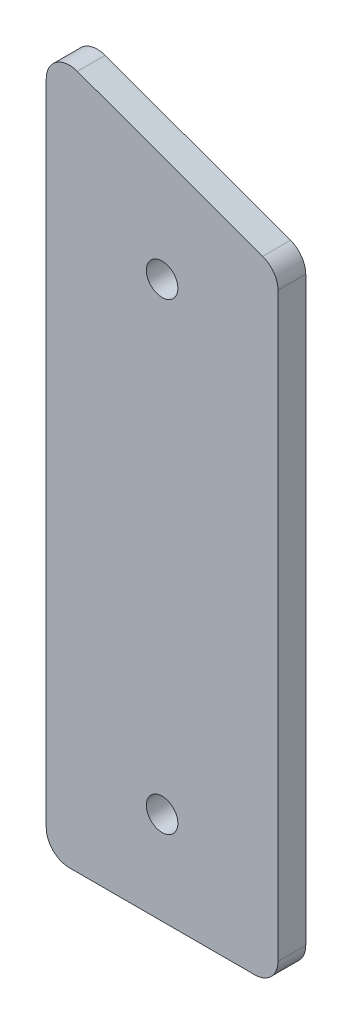
ISO-10303-21;
HEADER;
FILE_DESCRIPTION(('STEP AP214'),'2;1');
FILE_NAME('part.step','',(''),(''),'','','');
FILE_SCHEMA(('AUTOMOTIVE_DESIGN { 1 0 10303 214 1 1 1 1 }'));
ENDSEC;
DATA;
#1=APPLICATION_CONTEXT('core data for automotive mechanical design processes');
#2=APPLICATION_PROTOCOL_DEFINITION('international standard','automotive_design',2000,#1);
#3=PRODUCT_CONTEXT('',#1,'mechanical');
#4=PRODUCT('Part','Part','',(#3));
#5=PRODUCT_RELATED_PRODUCT_CATEGORY('part','',(#4));
#6=PRODUCT_DEFINITION_FORMATION('','',#4);
#7=PRODUCT_DEFINITION_CONTEXT('part definition',#1,'design');
#8=PRODUCT_DEFINITION('design','',#6,#7);
#9=PRODUCT_DEFINITION_SHAPE('','',#8);
#10=(LENGTH_UNIT() NAMED_UNIT(*) SI_UNIT(.MILLI.,.METRE.));
#11=(NAMED_UNIT(*) PLANE_ANGLE_UNIT() SI_UNIT($,.RADIAN.));
#12=(NAMED_UNIT(*) SI_UNIT($,.STERADIAN.) SOLID_ANGLE_UNIT());
#13=UNCERTAINTY_MEASURE_WITH_UNIT(LENGTH_MEASURE(1.E-05),#10,'distance_accuracy_value','');
#14=(GEOMETRIC_REPRESENTATION_CONTEXT(3) GLOBAL_UNCERTAINTY_ASSIGNED_CONTEXT((#13)) GLOBAL_UNIT_ASSIGNED_CONTEXT((#10,
#11,#12)) REPRESENTATION_CONTEXT('',''));
#15=CARTESIAN_POINT('',(0.,0.,0.));
#16=DIRECTION('',(0.,0.,1.));
#17=DIRECTION('',(1.,0.,0.));
#18=AXIS2_PLACEMENT_3D('',#15,#16,#17);
#19=CARTESIAN_POINT('',(20.,5.,6.));
#20=DIRECTION('',(0.,0.,-1.));
#21=DIRECTION('',(-1.,0.,0.));
#22=AXIS2_PLACEMENT_3D('',#19,#20,#21);
#23=PLANE('',#22);
#24=CARTESIAN_POINT('',(0.,120.,6.));
#25=DIRECTION('',(0.,0.,1.));
#26=DIRECTION('',(1.,0.,0.));
#27=AXIS2_PLACEMENT_3D('',#24,#25,#26);
#28=CIRCLE('',#27,3.40000000000003);
#29=CARTESIAN_POINT('',(3.40000000000003,120.,6.));
#30=VERTEX_POINT('',#29);
#31=EDGE_CURVE('E146',#30,#30,#28,.T.);
#32=ORIENTED_EDGE('',*,*,#31,.F.);
#33=EDGE_LOOP('',(#32));
#34=FACE_BOUND('',#33,.T.);
#35=CARTESIAN_POINT('',(20.,5.,6.));
#36=DIRECTION('',(0.,0.,1.));
#37=DIRECTION('',(-1.,0.,0.));
#38=AXIS2_PLACEMENT_3D('',#35,#36,#37);
#39=CIRCLE('',#38,5.);
#40=CARTESIAN_POINT('',(20.,0.,6.));
#41=VERTEX_POINT('',#40);
#42=CARTESIAN_POINT('',(25.,5.,6.));
#43=VERTEX_POINT('',#42);
#44=EDGE_CURVE('E157',#41,#43,#39,.T.);
#45=ORIENTED_EDGE('',*,*,#44,.T.);
#46=DIRECTION('',(0.,1.,0.));
#47=VECTOR('',#46,1.);
#48=CARTESIAN_POINT('',(25.,5.,6.));
#49=LINE('',#48,#47);
#50=CARTESIAN_POINT('',(25.,130.441190629352,6.));
#51=VERTEX_POINT('',#50);
#52=EDGE_CURVE('E105',#43,#51,#49,.T.);
#53=ORIENTED_EDGE('',*,*,#52,.T.);
#54=CARTESIAN_POINT('',(20.,130.441190629352,6.));
#55=DIRECTION('',(0.,0.,1.));
#56=DIRECTION('',(1.,0.,0.));
#57=AXIS2_PLACEMENT_3D('',#54,#55,#56);
#58=CIRCLE('',#57,5.00000000000001);
#59=CARTESIAN_POINT('',(21.7101007166284,135.139653733281,6.));
#60=VERTEX_POINT('',#59);
#61=EDGE_CURVE('E172',#51,#60,#58,.T.);
#62=ORIENTED_EDGE('',*,*,#61,.T.);
#63=DIRECTION('',(-0.939692620785906,0.342020143325674,0.));
#64=VECTOR('',#63,1.);
#65=CARTESIAN_POINT('',(-18.2898992833716,149.69846310393,6.));
#66=LINE('',#65,#64);
#67=CARTESIAN_POINT('',(-18.2898992833716,149.69846310393,6.));
#68=VERTEX_POINT('',#67);
#69=EDGE_CURVE('E185',#60,#68,#66,.T.);
#70=ORIENTED_EDGE('',*,*,#69,.T.);
#71=CARTESIAN_POINT('',(-20.,145.,6.));
#72=DIRECTION('',(0.,0.,1.));
#73=DIRECTION('',(1.,0.,0.));
#74=AXIS2_PLACEMENT_3D('',#71,#72,#73);
#75=CIRCLE('',#74,5.00000000000002);
#76=CARTESIAN_POINT('',(-25.,145.,6.));
#77=VERTEX_POINT('',#76);
#78=EDGE_CURVE('E124',#68,#77,#75,.T.);
#79=ORIENTED_EDGE('',*,*,#78,.T.);
#80=DIRECTION('',(0.,-1.,0.));
#81=VECTOR('',#80,1.);
#82=CARTESIAN_POINT('',(-25.,5.,6.));
#83=LINE('',#82,#81);
#84=CARTESIAN_POINT('',(-25.,5.,6.));
#85=VERTEX_POINT('',#84);
#86=EDGE_CURVE('E118',#77,#85,#83,.T.);
#87=ORIENTED_EDGE('',*,*,#86,.T.);
#88=CARTESIAN_POINT('',(-20.,5.,6.));
#89=DIRECTION('',(0.,0.,1.));
#90=DIRECTION('',(1.,0.,0.));
#91=AXIS2_PLACEMENT_3D('',#88,#89,#90);
#92=CIRCLE('',#91,5.);
#93=CARTESIAN_POINT('',(-20.,0.,6.));
#94=VERTEX_POINT('',#93);
#95=EDGE_CURVE('E122',#85,#94,#92,.T.);
#96=ORIENTED_EDGE('',*,*,#95,.T.);
#97=DIRECTION('',(1.,0.,0.));
#98=VECTOR('',#97,1.);
#99=CARTESIAN_POINT('',(-20.,0.,6.));
#100=LINE('',#99,#98);
#101=EDGE_CURVE('E62',#94,#41,#100,.T.);
#102=ORIENTED_EDGE('',*,*,#101,.T.);
#103=EDGE_LOOP('',(#45,#53,#62,#70,#79,#87,#96,#102));
#104=FACE_BOUND('',#103,.T.);
#105=CARTESIAN_POINT('',(0.,20.,6.));
#106=DIRECTION('',(0.,0.,1.));
#107=DIRECTION('',(1.,0.,0.));
#108=AXIS2_PLACEMENT_3D('',#105,#106,#107);
#109=CIRCLE('',#108,3.40000000000002);
#110=CARTESIAN_POINT('',(3.40000000000002,20.,6.));
#111=VERTEX_POINT('',#110);
#112=EDGE_CURVE('E194',#111,#111,#109,.T.);
#113=ORIENTED_EDGE('',*,*,#112,.F.);
#114=EDGE_LOOP('',(#113));
#115=FACE_BOUND('',#114,.T.);
#116=ADVANCED_FACE('F45',(#34,#104,#115),#23,.F.);
#117=CARTESIAN_POINT('',(20.,5.,0.));
#118=DIRECTION('',(0.,0.,-1.));
#119=DIRECTION('',(-1.,0.,0.));
#120=AXIS2_PLACEMENT_3D('',#117,#118,#119);
#121=PLANE('',#120);
#122=CARTESIAN_POINT('',(0.,120.,0.));
#123=DIRECTION('',(0.,0.,1.));
#124=DIRECTION('',(1.,0.,0.));
#125=AXIS2_PLACEMENT_3D('',#122,#123,#124);
#126=CIRCLE('',#125,3.40000000000003);
#127=CARTESIAN_POINT('',(3.40000000000003,120.,0.));
#128=VERTEX_POINT('',#127);
#129=EDGE_CURVE('E191',#128,#128,#126,.T.);
#130=ORIENTED_EDGE('',*,*,#129,.T.);
#131=EDGE_LOOP('',(#130));
#132=FACE_BOUND('',#131,.T.);
#133=CARTESIAN_POINT('',(20.,5.,0.));
#134=DIRECTION('',(0.,0.,1.));
#135=DIRECTION('',(-1.,0.,0.));
#136=AXIS2_PLACEMENT_3D('',#133,#134,#135);
#137=CIRCLE('',#136,5.);
#138=CARTESIAN_POINT('',(20.,0.,0.));
#139=VERTEX_POINT('',#138);
#140=CARTESIAN_POINT('',(25.,5.,0.));
#141=VERTEX_POINT('',#140);
#142=EDGE_CURVE('E142',#139,#141,#137,.T.);
#143=ORIENTED_EDGE('',*,*,#142,.F.);
#144=DIRECTION('',(1.,0.,0.));
#145=VECTOR('',#144,1.);
#146=CARTESIAN_POINT('',(-20.,0.,0.));
#147=LINE('',#146,#145);
#148=CARTESIAN_POINT('',(-20.,0.,0.));
#149=VERTEX_POINT('',#148);
#150=EDGE_CURVE('E97',#149,#139,#147,.T.);
#151=ORIENTED_EDGE('',*,*,#150,.F.);
#152=CARTESIAN_POINT('',(-20.,5.,0.));
#153=DIRECTION('',(0.,0.,1.));
#154=DIRECTION('',(1.,0.,0.));
#155=AXIS2_PLACEMENT_3D('',#152,#153,#154);
#156=CIRCLE('',#155,5.);
#157=CARTESIAN_POINT('',(-25.,5.,0.));
#158=VERTEX_POINT('',#157);
#159=EDGE_CURVE('E91',#158,#149,#156,.T.);
#160=ORIENTED_EDGE('',*,*,#159,.F.);
#161=DIRECTION('',(0.,-1.,0.));
#162=VECTOR('',#161,1.);
#163=CARTESIAN_POINT('',(-25.,5.,0.));
#164=LINE('',#163,#162);
#165=CARTESIAN_POINT('',(-25.,145.,0.));
#166=VERTEX_POINT('',#165);
#167=EDGE_CURVE('E132',#166,#158,#164,.T.);
#168=ORIENTED_EDGE('',*,*,#167,.F.);
#169=CARTESIAN_POINT('',(-20.,145.,0.));
#170=DIRECTION('',(0.,0.,1.));
#171=DIRECTION('',(1.,0.,0.));
#172=AXIS2_PLACEMENT_3D('',#169,#170,#171);
#173=CIRCLE('',#172,5.00000000000002);
#174=CARTESIAN_POINT('',(-18.2898992833716,149.69846310393,0.));
#175=VERTEX_POINT('',#174);
#176=EDGE_CURVE('E152',#175,#166,#173,.T.);
#177=ORIENTED_EDGE('',*,*,#176,.F.);
#178=DIRECTION('',(-0.939692620785906,0.342020143325674,0.));
#179=VECTOR('',#178,1.);
#180=CARTESIAN_POINT('',(-18.2898992833716,149.69846310393,0.));
#181=LINE('',#180,#179);
#182=CARTESIAN_POINT('',(21.7101007166284,135.139653733281,0.));
#183=VERTEX_POINT('',#182);
#184=EDGE_CURVE('E150',#183,#175,#181,.T.);
#185=ORIENTED_EDGE('',*,*,#184,.F.);
#186=CARTESIAN_POINT('',(20.,130.441190629352,0.));
#187=DIRECTION('',(0.,0.,1.));
#188=DIRECTION('',(1.,0.,0.));
#189=AXIS2_PLACEMENT_3D('',#186,#187,#188);
#190=CIRCLE('',#189,5.00000000000001);
#191=CARTESIAN_POINT('',(25.,130.441190629352,0.));
#192=VERTEX_POINT('',#191);
#193=EDGE_CURVE('E148',#192,#183,#190,.T.);
#194=ORIENTED_EDGE('',*,*,#193,.F.);
#195=DIRECTION('',(0.,1.,0.));
#196=VECTOR('',#195,1.);
#197=CARTESIAN_POINT('',(25.,5.,0.));
#198=LINE('',#197,#196);
#199=EDGE_CURVE('E145',#141,#192,#198,.T.);
#200=ORIENTED_EDGE('',*,*,#199,.F.);
#201=EDGE_LOOP('',(#143,#151,#160,#168,#177,#185,#194,#200));
#202=FACE_BOUND('',#201,.T.);
#203=CARTESIAN_POINT('',(0.,20.,0.));
#204=DIRECTION('',(0.,0.,1.));
#205=DIRECTION('',(1.,0.,0.));
#206=AXIS2_PLACEMENT_3D('',#203,#204,#205);
#207=CIRCLE('',#206,3.40000000000002);
#208=CARTESIAN_POINT('',(3.40000000000002,20.,0.));
#209=VERTEX_POINT('',#208);
#210=EDGE_CURVE('E197',#209,#209,#207,.T.);
#211=ORIENTED_EDGE('',*,*,#210,.T.);
#212=EDGE_LOOP('',(#211));
#213=FACE_BOUND('',#212,.T.);
#214=ADVANCED_FACE('F176',(#132,#202,#213),#121,.T.);
#215=CARTESIAN_POINT('',(20.,5.,6.));
#216=DIRECTION('',(0.,0.,-1.));
#217=DIRECTION('',(-1.,0.,0.));
#218=AXIS2_PLACEMENT_3D('',#215,#216,#217);
#219=CYLINDRICAL_SURFACE('',#218,5.);
#220=ORIENTED_EDGE('',*,*,#142,.T.);
#221=DIRECTION('',(0.,0.,-1.));
#222=VECTOR('',#221,1.);
#223=CARTESIAN_POINT('',(25.,5.,6.));
#224=LINE('',#223,#222);
#225=EDGE_CURVE('E11',#43,#141,#224,.T.);
#226=ORIENTED_EDGE('',*,*,#225,.F.);
#227=ORIENTED_EDGE('',*,*,#44,.F.);
#228=DIRECTION('',(0.,0.,-1.));
#229=VECTOR('',#228,1.);
#230=CARTESIAN_POINT('',(20.,0.,6.));
#231=LINE('',#230,#229);
#232=EDGE_CURVE('E138',#41,#139,#231,.T.);
#233=ORIENTED_EDGE('',*,*,#232,.T.);
#234=EDGE_LOOP('',(#220,#226,#227,#233));
#235=FACE_BOUND('',#234,.T.);
#236=ADVANCED_FACE('F47',(#235),#219,.T.);
#237=CARTESIAN_POINT('',(25.,5.,6.));
#238=DIRECTION('',(-1.,0.,0.));
#239=DIRECTION('',(0.,0.,1.));
#240=AXIS2_PLACEMENT_3D('',#237,#238,#239);
#241=PLANE('',#240);
#242=ORIENTED_EDGE('',*,*,#199,.T.);
#243=DIRECTION('',(0.,0.,-1.));
#244=VECTOR('',#243,1.);
#245=CARTESIAN_POINT('',(25.,130.441190629352,6.));
#246=LINE('',#245,#244);
#247=EDGE_CURVE('E54',#51,#192,#246,.T.);
#248=ORIENTED_EDGE('',*,*,#247,.F.);
#249=ORIENTED_EDGE('',*,*,#52,.F.);
#250=ORIENTED_EDGE('',*,*,#225,.T.);
#251=EDGE_LOOP('',(#242,#248,#249,#250));
#252=FACE_BOUND('',#251,.T.);
#253=ADVANCED_FACE('F230',(#252),#241,.F.);
#254=CARTESIAN_POINT('',(20.,130.441190629352,6.));
#255=DIRECTION('',(0.,0.,-1.));
#256=DIRECTION('',(-1.,0.,0.));
#257=AXIS2_PLACEMENT_3D('',#254,#255,#256);
#258=CYLINDRICAL_SURFACE('',#257,5.00000000000001);
#259=ORIENTED_EDGE('',*,*,#193,.T.);
#260=DIRECTION('',(0.,0.,-1.));
#261=VECTOR('',#260,1.);
#262=CARTESIAN_POINT('',(21.7101007166284,135.139653733281,6.));
#263=LINE('',#262,#261);
#264=EDGE_CURVE('E164',#60,#183,#263,.T.);
#265=ORIENTED_EDGE('',*,*,#264,.F.);
#266=ORIENTED_EDGE('',*,*,#61,.F.);
#267=ORIENTED_EDGE('',*,*,#247,.T.);
#268=EDGE_LOOP('',(#259,#265,#266,#267));
#269=FACE_BOUND('',#268,.T.);
#270=ADVANCED_FACE('F170',(#269),#258,.T.);
#271=CARTESIAN_POINT('',(-18.2898992833716,149.69846310393,6.));
#272=DIRECTION('',(-0.342020143325674,-0.939692620785906,0.));
#273=DIRECTION('',(0.939692620785907,-0.342020143325674,0.));
#274=AXIS2_PLACEMENT_3D('',#271,#272,#273);
#275=PLANE('',#274);
#276=ORIENTED_EDGE('',*,*,#184,.T.);
#277=DIRECTION('',(0.,0.,-1.));
#278=VECTOR('',#277,1.);
#279=CARTESIAN_POINT('',(-18.2898992833716,149.69846310393,6.));
#280=LINE('',#279,#278);
#281=EDGE_CURVE('E161',#68,#175,#280,.T.);
#282=ORIENTED_EDGE('',*,*,#281,.F.);
#283=ORIENTED_EDGE('',*,*,#69,.F.);
#284=ORIENTED_EDGE('',*,*,#264,.T.);
#285=EDGE_LOOP('',(#276,#282,#283,#284));
#286=FACE_BOUND('',#285,.T.);
#287=ADVANCED_FACE('F181',(#286),#275,.F.);
#288=CARTESIAN_POINT('',(-20.,145.,6.));
#289=DIRECTION('',(0.,0.,-1.));
#290=DIRECTION('',(-1.,0.,0.));
#291=AXIS2_PLACEMENT_3D('',#288,#289,#290);
#292=CYLINDRICAL_SURFACE('',#291,5.00000000000002);
#293=ORIENTED_EDGE('',*,*,#176,.T.);
#294=DIRECTION('',(0.,0.,-1.));
#295=VECTOR('',#294,1.);
#296=CARTESIAN_POINT('',(-25.,145.,6.));
#297=LINE('',#296,#295);
#298=EDGE_CURVE('E133',#77,#166,#297,.T.);
#299=ORIENTED_EDGE('',*,*,#298,.F.);
#300=ORIENTED_EDGE('',*,*,#78,.F.);
#301=ORIENTED_EDGE('',*,*,#281,.T.);
#302=EDGE_LOOP('',(#293,#299,#300,#301));
#303=FACE_BOUND('',#302,.T.);
#304=ADVANCED_FACE('F184',(#303),#292,.T.);
#305=CARTESIAN_POINT('',(-25.,5.,6.));
#306=DIRECTION('',(1.,0.,0.));
#307=DIRECTION('',(0.,0.,-1.));
#308=AXIS2_PLACEMENT_3D('',#305,#306,#307);
#309=PLANE('',#308);
#310=ORIENTED_EDGE('',*,*,#167,.T.);
#311=DIRECTION('',(0.,0.,-1.));
#312=VECTOR('',#311,1.);
#313=CARTESIAN_POINT('',(-25.,5.,6.));
#314=LINE('',#313,#312);
#315=EDGE_CURVE('E129',#85,#158,#314,.T.);
#316=ORIENTED_EDGE('',*,*,#315,.F.);
#317=ORIENTED_EDGE('',*,*,#86,.F.);
#318=ORIENTED_EDGE('',*,*,#298,.T.);
#319=EDGE_LOOP('',(#310,#316,#317,#318));
#320=FACE_BOUND('',#319,.T.);
#321=ADVANCED_FACE('F130',(#320),#309,.F.);
#322=CARTESIAN_POINT('',(-20.,5.,6.));
#323=DIRECTION('',(0.,0.,-1.));
#324=DIRECTION('',(-1.,0.,0.));
#325=AXIS2_PLACEMENT_3D('',#322,#323,#324);
#326=CYLINDRICAL_SURFACE('',#325,5.);
#327=ORIENTED_EDGE('',*,*,#159,.T.);
#328=DIRECTION('',(0.,0.,-1.));
#329=VECTOR('',#328,1.);
#330=CARTESIAN_POINT('',(-20.,0.,6.));
#331=LINE('',#330,#329);
#332=EDGE_CURVE('E134',#94,#149,#331,.T.);
#333=ORIENTED_EDGE('',*,*,#332,.F.);
#334=ORIENTED_EDGE('',*,*,#95,.F.);
#335=ORIENTED_EDGE('',*,*,#315,.T.);
#336=EDGE_LOOP('',(#327,#333,#334,#335));
#337=FACE_BOUND('',#336,.T.);
#338=ADVANCED_FACE('F136',(#337),#326,.T.);
#339=CARTESIAN_POINT('',(-20.,0.,6.));
#340=DIRECTION('',(0.,1.,0.));
#341=DIRECTION('',(0.,0.,1.));
#342=AXIS2_PLACEMENT_3D('',#339,#340,#341);
#343=PLANE('',#342);
#344=ORIENTED_EDGE('',*,*,#150,.T.);
#345=ORIENTED_EDGE('',*,*,#232,.F.);
#346=ORIENTED_EDGE('',*,*,#101,.F.);
#347=ORIENTED_EDGE('',*,*,#332,.T.);
#348=EDGE_LOOP('',(#344,#345,#346,#347));
#349=FACE_BOUND('',#348,.T.);
#350=ADVANCED_FACE('F218',(#349),#343,.F.);
#351=CARTESIAN_POINT('',(0.,120.,6.));
#352=DIRECTION('',(0.,0.,-1.));
#353=DIRECTION('',(-1.,0.,0.));
#354=AXIS2_PLACEMENT_3D('',#351,#352,#353);
#355=CYLINDRICAL_SURFACE('',#354,3.40000000000003);
#356=ORIENTED_EDGE('',*,*,#31,.T.);
#357=EDGE_LOOP('',(#356));
#358=FACE_BOUND('',#357,.T.);
#359=ORIENTED_EDGE('',*,*,#129,.F.);
#360=EDGE_LOOP('',(#359));
#361=FACE_BOUND('',#360,.T.);
#362=ADVANCED_FACE('F215',(#358,#361),#355,.F.);
#363=CARTESIAN_POINT('',(0.,20.,6.));
#364=DIRECTION('',(0.,0.,-1.));
#365=DIRECTION('',(-1.,0.,0.));
#366=AXIS2_PLACEMENT_3D('',#363,#364,#365);
#367=CYLINDRICAL_SURFACE('',#366,3.40000000000002);
#368=ORIENTED_EDGE('',*,*,#112,.T.);
#369=EDGE_LOOP('',(#368));
#370=FACE_BOUND('',#369,.T.);
#371=ORIENTED_EDGE('',*,*,#210,.F.);
#372=EDGE_LOOP('',(#371));
#373=FACE_BOUND('',#372,.T.);
#374=ADVANCED_FACE('F203',(#370,#373),#367,.F.);
#375=CLOSED_SHELL('',(#116,#214,#236,#253,#270,#287,#304,#321,#338,#350,#362,#374));
#376=MANIFOLD_SOLID_BREP('B2',#375);
#377=ADVANCED_BREP_SHAPE_REPRESENTATION('',(#18,#376),#14);
#378=SHAPE_DEFINITION_REPRESENTATION(#9,#377);
ENDSEC;
END-ISO-10303-21;
